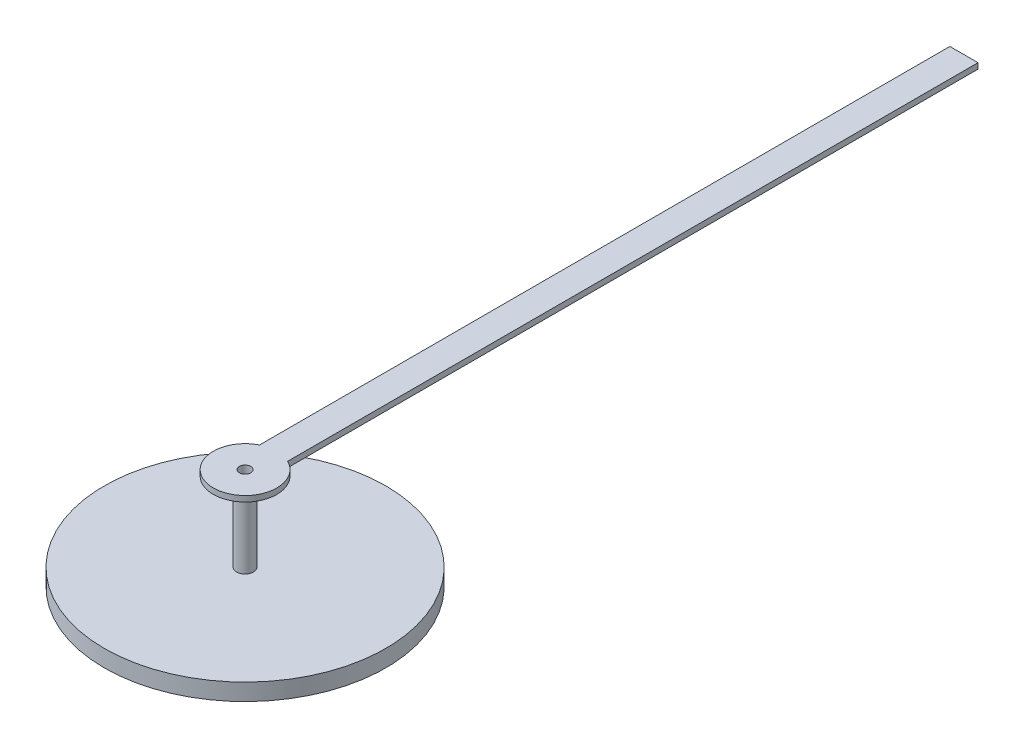
ISO-10303-21;
HEADER;
FILE_DESCRIPTION(('STEP AP214'),'2;1');
FILE_NAME('part.step','',(''),(''),'','','');
FILE_SCHEMA(('AUTOMOTIVE_DESIGN { 1 0 10303 214 1 1 1 1 }'));
ENDSEC;
DATA;
#1=APPLICATION_CONTEXT('core data for automotive mechanical design processes');
#2=APPLICATION_PROTOCOL_DEFINITION('international standard','automotive_design',2000,#1);
#3=PRODUCT_CONTEXT('',#1,'mechanical');
#4=PRODUCT('Part','Part','',(#3));
#5=PRODUCT_RELATED_PRODUCT_CATEGORY('part','',(#4));
#6=PRODUCT_DEFINITION_FORMATION('','',#4);
#7=PRODUCT_DEFINITION_CONTEXT('part definition',#1,'design');
#8=PRODUCT_DEFINITION('design','',#6,#7);
#9=PRODUCT_DEFINITION_SHAPE('','',#8);
#10=(LENGTH_UNIT() NAMED_UNIT(*) SI_UNIT(.MILLI.,.METRE.));
#11=(NAMED_UNIT(*) PLANE_ANGLE_UNIT() SI_UNIT($,.RADIAN.));
#12=(NAMED_UNIT(*) SI_UNIT($,.STERADIAN.) SOLID_ANGLE_UNIT());
#13=UNCERTAINTY_MEASURE_WITH_UNIT(LENGTH_MEASURE(1.E-05),#10,'distance_accuracy_value','');
#14=(GEOMETRIC_REPRESENTATION_CONTEXT(3) GLOBAL_UNCERTAINTY_ASSIGNED_CONTEXT((#13)) GLOBAL_UNIT_ASSIGNED_CONTEXT((#10,
#11,#12)) REPRESENTATION_CONTEXT('',''));
#15=CARTESIAN_POINT('',(0.,0.,0.));
#16=DIRECTION('',(0.,0.,1.));
#17=DIRECTION('',(1.,0.,0.));
#18=AXIS2_PLACEMENT_3D('',#15,#16,#17);
#19=CARTESIAN_POINT('',(0.,0.,0.));
#20=DIRECTION('',(0.,1.,0.));
#21=DIRECTION('',(0.,0.,1.));
#22=AXIS2_PLACEMENT_3D('',#19,#20,#21);
#23=PLANE('',#22);
#24=DIRECTION('',(0.,0.,1.));
#25=VECTOR('',#24,1.);
#26=CARTESIAN_POINT('',(-0.25,0.,-12.7639476237443));
#27=LINE('',#26,#25);
#28=CARTESIAN_POINT('',(-0.25,0.,-12.7639476237443));
#29=VERTEX_POINT('',#28);
#30=CARTESIAN_POINT('',(-0.25,0.,-0.505972083040145));
#31=VERTEX_POINT('',#30);
#32=EDGE_CURVE('E102',#29,#31,#27,.T.);
#33=ORIENTED_EDGE('',*,*,#32,.F.);
#34=DIRECTION('',(-1.,0.,0.));
#35=VECTOR('',#34,1.);
#36=CARTESIAN_POINT('',(-0.25,0.,-12.7639476237443));
#37=LINE('',#36,#35);
#38=CARTESIAN_POINT('',(0.25,0.,-12.7639476237443));
#39=VERTEX_POINT('',#38);
#40=EDGE_CURVE('E75',#39,#29,#37,.T.);
#41=ORIENTED_EDGE('',*,*,#40,.F.);
#42=DIRECTION('',(0.,0.,-1.));
#43=VECTOR('',#42,1.);
#44=CARTESIAN_POINT('',(0.25,0.,-12.7639476237443));
#45=LINE('',#44,#43);
#46=CARTESIAN_POINT('',(0.25,0.,-0.505972083040146));
#47=VERTEX_POINT('',#46);
#48=EDGE_CURVE('E69',#47,#39,#45,.T.);
#49=ORIENTED_EDGE('',*,*,#48,.F.);
#50=CARTESIAN_POINT('',(0.,0.,0.));
#51=DIRECTION('',(0.,1.,0.));
#52=DIRECTION('',(0.,0.,1.));
#53=AXIS2_PLACEMENT_3D('',#50,#51,#52);
#54=CIRCLE('',#53,0.564364907498671);
#55=EDGE_CURVE('E93',#31,#47,#54,.T.);
#56=ORIENTED_EDGE('',*,*,#55,.F.);
#57=EDGE_LOOP('',(#33,#41,#49,#56));
#58=FACE_BOUND('',#57,.T.);
#59=CARTESIAN_POINT('',(0.,0.,0.));
#60=DIRECTION('',(0.,1.,0.));
#61=DIRECTION('',(0.,0.,1.));
#62=AXIS2_PLACEMENT_3D('',#59,#60,#61);
#63=CIRCLE('',#62,0.15);
#64=CARTESIAN_POINT('',(0.,0.,0.15));
#65=VERTEX_POINT('',#64);
#66=EDGE_CURVE('E11',#65,#65,#63,.F.);
#67=ORIENTED_EDGE('',*,*,#66,.F.);
#68=EDGE_LOOP('',(#67));
#69=FACE_BOUND('',#68,.T.);
#70=ADVANCED_FACE('F35',(#58,#69),#23,.F.);
#71=CARTESIAN_POINT('',(-0.25,0.1,-12.7639476237443));
#72=DIRECTION('',(1.,0.,0.));
#73=DIRECTION('',(0.,0.,-1.));
#74=AXIS2_PLACEMENT_3D('',#71,#72,#73);
#75=PLANE('',#74);
#76=ORIENTED_EDGE('',*,*,#32,.T.);
#77=DIRECTION('',(0.,-1.,0.));
#78=VECTOR('',#77,1.);
#79=CARTESIAN_POINT('',(-0.25,0.1,-0.505972083040145));
#80=LINE('',#79,#78);
#81=CARTESIAN_POINT('',(-0.25,0.1,-0.505972083040145));
#82=VERTEX_POINT('',#81);
#83=EDGE_CURVE('E44',#82,#31,#80,.T.);
#84=ORIENTED_EDGE('',*,*,#83,.F.);
#85=DIRECTION('',(0.,0.,1.));
#86=VECTOR('',#85,1.);
#87=CARTESIAN_POINT('',(-0.25,0.1,-12.7639476237443));
#88=LINE('',#87,#86);
#89=CARTESIAN_POINT('',(-0.25,0.1,-12.7639476237443));
#90=VERTEX_POINT('',#89);
#91=EDGE_CURVE('E88',#90,#82,#88,.T.);
#92=ORIENTED_EDGE('',*,*,#91,.F.);
#93=DIRECTION('',(0.,-1.,0.));
#94=VECTOR('',#93,1.);
#95=CARTESIAN_POINT('',(-0.25,0.1,-12.7639476237443));
#96=LINE('',#95,#94);
#97=EDGE_CURVE('E98',#90,#29,#96,.T.);
#98=ORIENTED_EDGE('',*,*,#97,.T.);
#99=EDGE_LOOP('',(#76,#84,#92,#98));
#100=FACE_BOUND('',#99,.T.);
#101=ADVANCED_FACE('F37',(#100),#75,.F.);
#102=CARTESIAN_POINT('',(0.,0.1,0.));
#103=DIRECTION('',(0.,-1.,0.));
#104=DIRECTION('',(0.,0.,-1.));
#105=AXIS2_PLACEMENT_3D('',#102,#103,#104);
#106=CYLINDRICAL_SURFACE('',#105,0.564364907498671);
#107=ORIENTED_EDGE('',*,*,#55,.T.);
#108=DIRECTION('',(0.,-1.,0.));
#109=VECTOR('',#108,1.);
#110=CARTESIAN_POINT('',(0.25,0.1,-0.505972083040146));
#111=LINE('',#110,#109);
#112=CARTESIAN_POINT('',(0.25,0.1,-0.505972083040146));
#113=VERTEX_POINT('',#112);
#114=EDGE_CURVE('E91',#113,#47,#111,.T.);
#115=ORIENTED_EDGE('',*,*,#114,.F.);
#116=CARTESIAN_POINT('',(0.,0.1,0.));
#117=DIRECTION('',(0.,1.,0.));
#118=DIRECTION('',(0.,0.,1.));
#119=AXIS2_PLACEMENT_3D('',#116,#117,#118);
#120=CIRCLE('',#119,0.564364907498671);
#121=EDGE_CURVE('E83',#82,#113,#120,.T.);
#122=ORIENTED_EDGE('',*,*,#121,.F.);
#123=ORIENTED_EDGE('',*,*,#83,.T.);
#124=EDGE_LOOP('',(#107,#115,#122,#123));
#125=FACE_BOUND('',#124,.T.);
#126=ADVANCED_FACE('F92',(#125),#106,.T.);
#127=CARTESIAN_POINT('',(0.25,0.1,-12.7639476237443));
#128=DIRECTION('',(-1.,0.,0.));
#129=DIRECTION('',(0.,0.,1.));
#130=AXIS2_PLACEMENT_3D('',#127,#128,#129);
#131=PLANE('',#130);
#132=ORIENTED_EDGE('',*,*,#48,.T.);
#133=DIRECTION('',(0.,-1.,0.));
#134=VECTOR('',#133,1.);
#135=CARTESIAN_POINT('',(0.25,0.1,-12.7639476237443));
#136=LINE('',#135,#134);
#137=CARTESIAN_POINT('',(0.25,0.1,-12.7639476237443));
#138=VERTEX_POINT('',#137);
#139=EDGE_CURVE('E94',#138,#39,#136,.T.);
#140=ORIENTED_EDGE('',*,*,#139,.F.);
#141=DIRECTION('',(0.,0.,-1.));
#142=VECTOR('',#141,1.);
#143=CARTESIAN_POINT('',(0.25,0.1,-12.7639476237443));
#144=LINE('',#143,#142);
#145=EDGE_CURVE('E86',#113,#138,#144,.T.);
#146=ORIENTED_EDGE('',*,*,#145,.F.);
#147=ORIENTED_EDGE('',*,*,#114,.T.);
#148=EDGE_LOOP('',(#132,#140,#146,#147));
#149=FACE_BOUND('',#148,.T.);
#150=ADVANCED_FACE('F96',(#149),#131,.F.);
#151=CARTESIAN_POINT('',(-0.25,0.1,-12.7639476237443));
#152=DIRECTION('',(0.,0.,1.));
#153=DIRECTION('',(1.,0.,0.));
#154=AXIS2_PLACEMENT_3D('',#151,#152,#153);
#155=PLANE('',#154);
#156=ORIENTED_EDGE('',*,*,#40,.T.);
#157=ORIENTED_EDGE('',*,*,#97,.F.);
#158=DIRECTION('',(-1.,0.,0.));
#159=VECTOR('',#158,1.);
#160=CARTESIAN_POINT('',(-0.25,0.1,-12.7639476237443));
#161=LINE('',#160,#159);
#162=EDGE_CURVE('E52',#138,#90,#161,.T.);
#163=ORIENTED_EDGE('',*,*,#162,.F.);
#164=ORIENTED_EDGE('',*,*,#139,.T.);
#165=EDGE_LOOP('',(#156,#157,#163,#164));
#166=FACE_BOUND('',#165,.T.);
#167=ADVANCED_FACE('F130',(#166),#155,.F.);
#168=CARTESIAN_POINT('',(0.,0.1,0.));
#169=DIRECTION('',(0.,1.,0.));
#170=DIRECTION('',(0.,0.,1.));
#171=AXIS2_PLACEMENT_3D('',#168,#169,#170);
#172=PLANE('',#171);
#173=CARTESIAN_POINT('',(0.,0.1,0.));
#174=DIRECTION('',(0.,1.,0.));
#175=DIRECTION('',(0.,0.,1.));
#176=AXIS2_PLACEMENT_3D('',#173,#174,#175);
#177=CIRCLE('',#176,0.1);
#178=CARTESIAN_POINT('',(0.,0.1,0.1));
#179=VERTEX_POINT('',#178);
#180=EDGE_CURVE('E207',#179,#179,#177,.T.);
#181=ORIENTED_EDGE('',*,*,#180,.F.);
#182=EDGE_LOOP('',(#181));
#183=FACE_BOUND('',#182,.T.);
#184=ORIENTED_EDGE('',*,*,#91,.T.);
#185=ORIENTED_EDGE('',*,*,#121,.T.);
#186=ORIENTED_EDGE('',*,*,#145,.T.);
#187=ORIENTED_EDGE('',*,*,#162,.T.);
#188=EDGE_LOOP('',(#184,#185,#186,#187));
#189=FACE_BOUND('',#188,.T.);
#190=ADVANCED_FACE('F84',(#183,#189),#172,.T.);
#191=CARTESIAN_POINT('',(0.,-1.4,0.));
#192=DIRECTION('',(0.,1.,0.));
#193=DIRECTION('',(0.,0.,1.));
#194=AXIS2_PLACEMENT_3D('',#191,#192,#193);
#195=CYLINDRICAL_SURFACE('',#194,0.15);
#196=CARTESIAN_POINT('',(0.,-1.4,0.));
#197=DIRECTION('',(0.,-1.,0.));
#198=DIRECTION('',(0.,0.,-1.));
#199=AXIS2_PLACEMENT_3D('',#196,#197,#198);
#200=CIRCLE('',#199,0.15);
#201=CARTESIAN_POINT('',(0.,-1.4,-0.15));
#202=VERTEX_POINT('',#201);
#203=EDGE_CURVE('E105',#202,#202,#200,.T.);
#204=ORIENTED_EDGE('',*,*,#203,.F.);
#205=EDGE_LOOP('',(#204));
#206=FACE_BOUND('',#205,.T.);
#207=ORIENTED_EDGE('',*,*,#66,.T.);
#208=EDGE_LOOP('',(#207));
#209=FACE_BOUND('',#208,.T.);
#210=ADVANCED_FACE('F118',(#206,#209),#195,.T.);
#211=CARTESIAN_POINT('',(0.,-1.4,0.));
#212=DIRECTION('',(0.,-1.,0.));
#213=DIRECTION('',(0.,0.,-1.));
#214=AXIS2_PLACEMENT_3D('',#211,#212,#213);
#215=PLANE('',#214);
#216=CARTESIAN_POINT('',(0.,-1.4,0.));
#217=DIRECTION('',(0.,-1.,0.));
#218=DIRECTION('',(0.,0.,-1.));
#219=AXIS2_PLACEMENT_3D('',#216,#217,#218);
#220=CIRCLE('',#219,2.5);
#221=CARTESIAN_POINT('',(0.,-1.4,-2.5));
#222=VERTEX_POINT('',#221);
#223=EDGE_CURVE('E209',#222,#222,#220,.T.);
#224=ORIENTED_EDGE('',*,*,#223,.F.);
#225=EDGE_LOOP('',(#224));
#226=FACE_BOUND('',#225,.T.);
#227=ORIENTED_EDGE('',*,*,#203,.T.);
#228=EDGE_LOOP('',(#227));
#229=FACE_BOUND('',#228,.T.);
#230=ADVANCED_FACE('F120',(#226,#229),#215,.F.);
#231=CARTESIAN_POINT('',(0.,-1.7,0.));
#232=DIRECTION('',(0.,1.,0.));
#233=DIRECTION('',(0.,0.,1.));
#234=AXIS2_PLACEMENT_3D('',#231,#232,#233);
#235=CYLINDRICAL_SURFACE('',#234,2.5);
#236=CARTESIAN_POINT('',(0.,-1.7,0.));
#237=DIRECTION('',(0.,-1.,0.));
#238=DIRECTION('',(0.,0.,-1.));
#239=AXIS2_PLACEMENT_3D('',#236,#237,#238);
#240=CIRCLE('',#239,2.5);
#241=CARTESIAN_POINT('',(0.,-1.7,-2.5));
#242=VERTEX_POINT('',#241);
#243=EDGE_CURVE('E212',#242,#242,#240,.T.);
#244=ORIENTED_EDGE('',*,*,#243,.F.);
#245=EDGE_LOOP('',(#244));
#246=FACE_BOUND('',#245,.T.);
#247=ORIENTED_EDGE('',*,*,#223,.T.);
#248=EDGE_LOOP('',(#247));
#249=FACE_BOUND('',#248,.T.);
#250=ADVANCED_FACE('F127',(#246,#249),#235,.T.);
#251=CARTESIAN_POINT('',(0.,-1.7,0.));
#252=DIRECTION('',(0.,-1.,0.));
#253=DIRECTION('',(0.,0.,-1.));
#254=AXIS2_PLACEMENT_3D('',#251,#252,#253);
#255=PLANE('',#254);
#256=CARTESIAN_POINT('',(0.,-1.7,0.));
#257=DIRECTION('',(0.,1.,0.));
#258=DIRECTION('',(0.,0.,1.));
#259=AXIS2_PLACEMENT_3D('',#256,#257,#258);
#260=CIRCLE('',#259,0.1);
#261=CARTESIAN_POINT('',(0.,-1.7,0.1));
#262=VERTEX_POINT('',#261);
#263=EDGE_CURVE('E204',#262,#262,#260,.T.);
#264=ORIENTED_EDGE('',*,*,#263,.T.);
#265=EDGE_LOOP('',(#264));
#266=FACE_BOUND('',#265,.T.);
#267=ORIENTED_EDGE('',*,*,#243,.T.);
#268=EDGE_LOOP('',(#267));
#269=FACE_BOUND('',#268,.T.);
#270=ADVANCED_FACE('F173',(#266,#269),#255,.T.);
#271=CARTESIAN_POINT('',(0.,-1.7,0.));
#272=DIRECTION('',(0.,1.,0.));
#273=DIRECTION('',(0.,0.,1.));
#274=AXIS2_PLACEMENT_3D('',#271,#272,#273);
#275=CYLINDRICAL_SURFACE('',#274,0.1);
#276=ORIENTED_EDGE('',*,*,#263,.F.);
#277=EDGE_LOOP('',(#276));
#278=FACE_BOUND('',#277,.T.);
#279=ORIENTED_EDGE('',*,*,#180,.T.);
#280=EDGE_LOOP('',(#279));
#281=FACE_BOUND('',#280,.T.);
#282=ADVANCED_FACE('F187',(#278,#281),#275,.F.);
#283=CLOSED_SHELL('',(#70,#101,#126,#150,#167,#190,#210,#230,#250,#270,#282));
#284=MANIFOLD_SOLID_BREP('B2',#283);
#285=ADVANCED_BREP_SHAPE_REPRESENTATION('',(#18,#284),#14);
#286=SHAPE_DEFINITION_REPRESENTATION(#9,#285);
ENDSEC;
END-ISO-10303-21;
